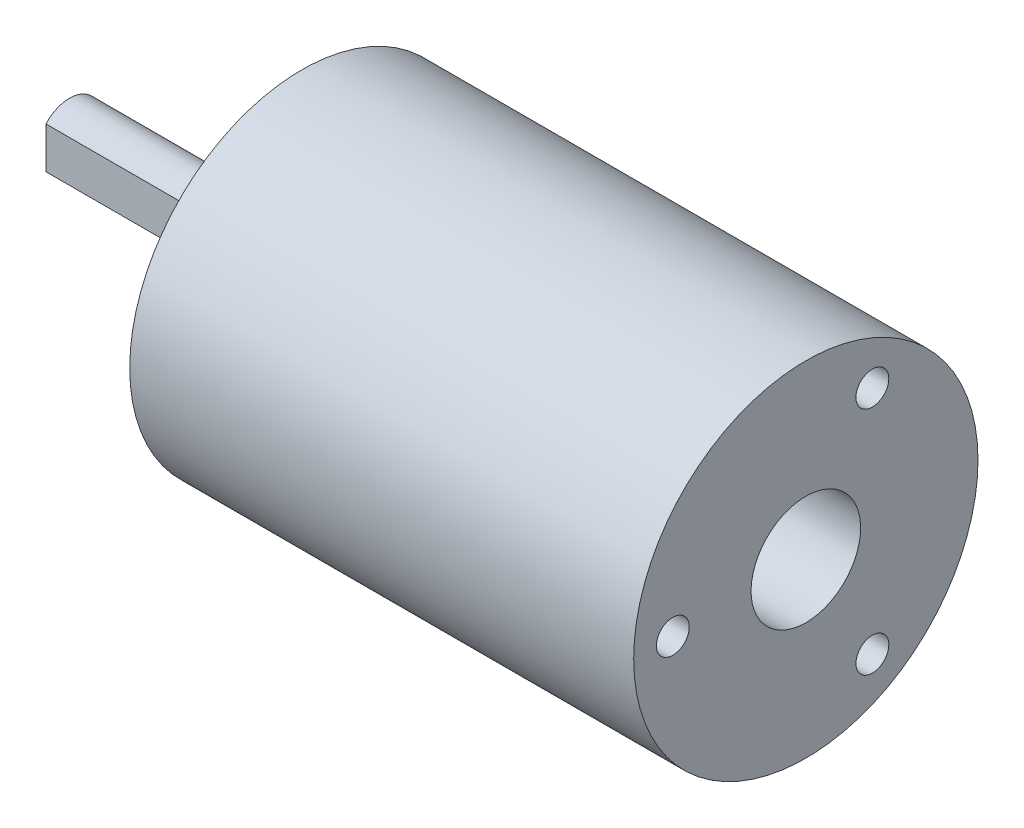
ISO-10303-21;
HEADER;
FILE_DESCRIPTION(('STEP AP214'),'2;1');
FILE_NAME('part.step','',(''),(''),'','','');
FILE_SCHEMA(('AUTOMOTIVE_DESIGN { 1 0 10303 214 1 1 1 1 }'));
ENDSEC;
DATA;
#1=APPLICATION_CONTEXT('core data for automotive mechanical design processes');
#2=APPLICATION_PROTOCOL_DEFINITION('international standard','automotive_design',2000,#1);
#3=PRODUCT_CONTEXT('',#1,'mechanical');
#4=PRODUCT('Part','Part','',(#3));
#5=PRODUCT_RELATED_PRODUCT_CATEGORY('part','',(#4));
#6=PRODUCT_DEFINITION_FORMATION('','',#4);
#7=PRODUCT_DEFINITION_CONTEXT('part definition',#1,'design');
#8=PRODUCT_DEFINITION('design','',#6,#7);
#9=PRODUCT_DEFINITION_SHAPE('','',#8);
#10=(LENGTH_UNIT() NAMED_UNIT(*) SI_UNIT(.MILLI.,.METRE.));
#11=(NAMED_UNIT(*) PLANE_ANGLE_UNIT() SI_UNIT($,.RADIAN.));
#12=(NAMED_UNIT(*) SI_UNIT($,.STERADIAN.) SOLID_ANGLE_UNIT());
#13=UNCERTAINTY_MEASURE_WITH_UNIT(LENGTH_MEASURE(1.E-05),#10,'distance_accuracy_value','');
#14=(GEOMETRIC_REPRESENTATION_CONTEXT(3) GLOBAL_UNCERTAINTY_ASSIGNED_CONTEXT((#13)) GLOBAL_UNIT_ASSIGNED_CONTEXT((#10,
#11,#12)) REPRESENTATION_CONTEXT('',''));
#15=CARTESIAN_POINT('',(0.,0.,0.));
#16=DIRECTION('',(0.,0.,1.));
#17=DIRECTION('',(1.,0.,0.));
#18=AXIS2_PLACEMENT_3D('',#15,#16,#17);
#19=CARTESIAN_POINT('',(-5.85,-1.32287565553,1.5));
#20=DIRECTION('',(-0.707106781186547,0.,0.707106781186548));
#21=DIRECTION('',(0.707106781186548,0.,0.707106781186547));
#22=AXIS2_PLACEMENT_3D('',#19,#20,#21);
#23=PLANE('',#22);
#24=CARTESIAN_POINT('',(-7.35,0.,0.));
#25=DIRECTION('',(-0.707106781186547,0.,0.707106781186548));
#26=DIRECTION('',(-0.707106781186548,0.,-0.707106781186547));
#27=AXIS2_PLACEMENT_3D('',#24,#25,#26);
#28=ELLIPSE('',#27,2.82842712474619,2.);
#29=CARTESIAN_POINT('',(-5.84999999999943,1.32287565553165,1.50000000000057));
#30=VERTEX_POINT('',#29);
#31=CARTESIAN_POINT('',(-5.84999999999943,-1.32287565553165,1.50000000000057));
#32=VERTEX_POINT('',#31);
#33=EDGE_CURVE('E18',#30,#32,#28,.F.);
#34=ORIENTED_EDGE('',*,*,#33,.F.);
#35=DIRECTION('',(0.,1.,0.));
#36=VECTOR('',#35,1.);
#37=CARTESIAN_POINT('',(-5.85,1.32287565553,1.5));
#38=LINE('',#37,#36);
#39=EDGE_CURVE('E39',#32,#30,#38,.T.);
#40=ORIENTED_EDGE('',*,*,#39,.F.);
#41=EDGE_LOOP('',(#34,#40));
#42=FACE_BOUND('',#41,.T.);
#43=ADVANCED_FACE('F15',(#42),#23,.T.);
#44=CARTESIAN_POINT('',(-14.85,1.32287565553,1.5));
#45=DIRECTION('',(0.,0.,1.));
#46=DIRECTION('',(1.,0.,0.));
#47=AXIS2_PLACEMENT_3D('',#44,#45,#46);
#48=PLANE('',#47);
#49=ORIENTED_EDGE('',*,*,#39,.T.);
#50=DIRECTION('',(-1.,0.,0.));
#51=VECTOR('',#50,1.);
#52=CARTESIAN_POINT('',(-3.14999999,1.322875655531,1.50000000000114));
#53=LINE('',#52,#51);
#54=CARTESIAN_POINT('',(-14.85,1.32287565553165,1.50000000000057));
#55=VERTEX_POINT('',#54);
#56=EDGE_CURVE('E43',#55,#30,#53,.F.);
#57=ORIENTED_EDGE('',*,*,#56,.F.);
#58=DIRECTION('',(0.,-1.,0.));
#59=VECTOR('',#58,1.);
#60=CARTESIAN_POINT('',(-14.85,1.32287565553,1.5));
#61=LINE('',#60,#59);
#62=CARTESIAN_POINT('',(-14.85,-1.32287565553165,1.50000000000057));
#63=VERTEX_POINT('',#62);
#64=EDGE_CURVE('E32',#63,#55,#61,.F.);
#65=ORIENTED_EDGE('',*,*,#64,.F.);
#66=DIRECTION('',(-1.,0.,0.));
#67=VECTOR('',#66,1.);
#68=CARTESIAN_POINT('',(-3.14999999,-1.322875655531,1.50000000000114));
#69=LINE('',#68,#67);
#70=EDGE_CURVE('E45',#32,#63,#69,.T.);
#71=ORIENTED_EDGE('',*,*,#70,.F.);
#72=EDGE_LOOP('',(#49,#57,#65,#71));
#73=FACE_BOUND('',#72,.T.);
#74=ADVANCED_FACE('F41',(#73),#48,.T.);
#75=CARTESIAN_POINT('',(-14.85,1.32287565553,1.5));
#76=DIRECTION('',(-1.,0.,0.));
#77=DIRECTION('',(0.,-1.,0.));
#78=AXIS2_PLACEMENT_3D('',#75,#76,#77);
#79=PLANE('',#78);
#80=ORIENTED_EDGE('',*,*,#64,.T.);
#81=CARTESIAN_POINT('',(-14.85,0.,0.));
#82=DIRECTION('',(-1.,0.,0.));
#83=DIRECTION('',(0.,0.,1.));
#84=AXIS2_PLACEMENT_3D('',#81,#82,#83);
#85=CIRCLE('',#84,2.);
#86=EDGE_CURVE('E52',#63,#55,#85,.F.);
#87=ORIENTED_EDGE('',*,*,#86,.F.);
#88=EDGE_LOOP('',(#80,#87));
#89=FACE_BOUND('',#88,.T.);
#90=ADVANCED_FACE('F121',(#89),#79,.T.);
#91=CARTESIAN_POINT('',(-3.14999999,0.,0.));
#92=DIRECTION('',(-1.,0.,0.));
#93=DIRECTION('',(0.,0.,1.));
#94=AXIS2_PLACEMENT_3D('',#91,#92,#93);
#95=CYLINDRICAL_SURFACE('',#94,2.);
#96=CARTESIAN_POINT('',(-3.15,0.,0.));
#97=DIRECTION('',(-1.,0.,0.));
#98=DIRECTION('',(0.,0.,1.));
#99=AXIS2_PLACEMENT_3D('',#96,#97,#98);
#100=CIRCLE('',#99,2.);
#101=CARTESIAN_POINT('',(-3.15,0.,2.));
#102=VERTEX_POINT('',#101);
#103=EDGE_CURVE('E113',#102,#102,#100,.F.);
#104=ORIENTED_EDGE('',*,*,#103,.F.);
#105=EDGE_LOOP('',(#104));
#106=FACE_BOUND('',#105,.T.);
#107=ORIENTED_EDGE('',*,*,#70,.T.);
#108=ORIENTED_EDGE('',*,*,#86,.T.);
#109=ORIENTED_EDGE('',*,*,#56,.T.);
#110=ORIENTED_EDGE('',*,*,#33,.T.);
#111=EDGE_LOOP('',(#107,#108,#109,#110));
#112=FACE_BOUND('',#111,.T.);
#113=ADVANCED_FACE('F51',(#106,#112),#95,.T.);
#114=CARTESIAN_POINT('',(-3.15,-3.5,0.));
#115=DIRECTION('',(-1.,0.,0.));
#116=DIRECTION('',(0.,-1.,0.));
#117=AXIS2_PLACEMENT_3D('',#114,#115,#116);
#118=PLANE('',#117);
#119=ORIENTED_EDGE('',*,*,#103,.T.);
#120=EDGE_LOOP('',(#119));
#121=FACE_BOUND('',#120,.T.);
#122=CARTESIAN_POINT('',(-3.15,0.,0.));
#123=DIRECTION('',(-1.,0.,0.));
#124=DIRECTION('',(0.,-1.,0.));
#125=AXIS2_PLACEMENT_3D('',#122,#123,#124);
#126=CIRCLE('',#125,3.5);
#127=CARTESIAN_POINT('',(-3.15,-3.5,0.));
#128=VERTEX_POINT('',#127);
#129=EDGE_CURVE('E110',#128,#128,#126,.F.);
#130=ORIENTED_EDGE('',*,*,#129,.F.);
#131=EDGE_LOOP('',(#130));
#132=FACE_BOUND('',#131,.T.);
#133=ADVANCED_FACE('F117',(#121,#132),#118,.T.);
#134=CARTESIAN_POINT('',(-1.34999999,0.,0.));
#135=DIRECTION('',(-1.,0.,0.));
#136=DIRECTION('',(0.,-1.,0.));
#137=AXIS2_PLACEMENT_3D('',#134,#135,#136);
#138=CYLINDRICAL_SURFACE('',#137,3.5);
#139=ORIENTED_EDGE('',*,*,#129,.T.);
#140=EDGE_LOOP('',(#139));
#141=FACE_BOUND('',#140,.T.);
#142=CARTESIAN_POINT('',(-1.35,0.,0.));
#143=DIRECTION('',(-1.,0.,0.));
#144=DIRECTION('',(0.,-1.,0.));
#145=AXIS2_PLACEMENT_3D('',#142,#143,#144);
#146=CIRCLE('',#145,3.5);
#147=CARTESIAN_POINT('',(-1.35,-3.5,0.));
#148=VERTEX_POINT('',#147);
#149=EDGE_CURVE('E107',#148,#148,#146,.F.);
#150=ORIENTED_EDGE('',*,*,#149,.F.);
#151=EDGE_LOOP('',(#150));
#152=FACE_BOUND('',#151,.T.);
#153=ADVANCED_FACE('F128',(#141,#152),#138,.T.);
#154=CARTESIAN_POINT('',(29.2,7.88621593217,-3.34067332603));
#155=DIRECTION('',(1.,0.,0.));
#156=DIRECTION('',(0.,0.,-1.));
#157=AXIS2_PLACEMENT_3D('',#154,#155,#156);
#158=PLANE('',#157);
#159=CARTESIAN_POINT('',(29.2,7.36121593217,-4.25));
#160=DIRECTION('',(-1.,0.,0.));
#161=DIRECTION('',(0.,-1.,0.));
#162=AXIS2_PLACEMENT_3D('',#159,#160,#161);
#163=CIRCLE('',#162,1.05);
#164=CARTESIAN_POINT('',(29.2,6.31121593217,-4.25));
#165=VERTEX_POINT('',#164);
#166=EDGE_CURVE('E104',#165,#165,#163,.F.);
#167=ORIENTED_EDGE('',*,*,#166,.T.);
#168=EDGE_LOOP('',(#167));
#169=FACE_BOUND('',#168,.T.);
#170=ADVANCED_FACE('F207',(#169),#158,.T.);
#171=CARTESIAN_POINT('',(29.2,-6.83621593217,-5.15932667397));
#172=DIRECTION('',(1.,0.,0.));
#173=DIRECTION('',(0.,0.,-1.));
#174=AXIS2_PLACEMENT_3D('',#171,#172,#173);
#175=PLANE('',#174);
#176=CARTESIAN_POINT('',(29.2,-7.36121593217,-4.25));
#177=DIRECTION('',(-1.,0.,0.));
#178=DIRECTION('',(0.,-1.,0.));
#179=AXIS2_PLACEMENT_3D('',#176,#177,#178);
#180=CIRCLE('',#179,1.05);
#181=CARTESIAN_POINT('',(29.2,-8.41121593217,-4.25));
#182=VERTEX_POINT('',#181);
#183=EDGE_CURVE('E101',#182,#182,#180,.F.);
#184=ORIENTED_EDGE('',*,*,#183,.T.);
#185=EDGE_LOOP('',(#184));
#186=FACE_BOUND('',#185,.T.);
#187=ADVANCED_FACE('F203',(#186),#175,.T.);
#188=CARTESIAN_POINT('',(29.2,1.05,8.5));
#189=DIRECTION('',(1.,0.,0.));
#190=DIRECTION('',(0.,0.,-1.));
#191=AXIS2_PLACEMENT_3D('',#188,#189,#190);
#192=PLANE('',#191);
#193=CARTESIAN_POINT('',(29.2,0.,8.5));
#194=DIRECTION('',(-1.,0.,0.));
#195=DIRECTION('',(0.,-1.,0.));
#196=AXIS2_PLACEMENT_3D('',#193,#194,#195);
#197=CIRCLE('',#196,1.05);
#198=CARTESIAN_POINT('',(29.2,-1.05,8.5));
#199=VERTEX_POINT('',#198);
#200=EDGE_CURVE('E98',#199,#199,#197,.F.);
#201=ORIENTED_EDGE('',*,*,#200,.T.);
#202=EDGE_LOOP('',(#201));
#203=FACE_BOUND('',#202,.T.);
#204=ADVANCED_FACE('F199',(#203),#192,.T.);
#205=CARTESIAN_POINT('',(25.8,3.5,0.));
#206=DIRECTION('',(1.,0.,0.));
#207=DIRECTION('',(0.,0.,-1.));
#208=AXIS2_PLACEMENT_3D('',#205,#206,#207);
#209=PLANE('',#208);
#210=CARTESIAN_POINT('',(25.8,0.,0.));
#211=DIRECTION('',(-1.,0.,0.));
#212=DIRECTION('',(0.,-1.,0.));
#213=AXIS2_PLACEMENT_3D('',#210,#211,#212);
#214=CIRCLE('',#213,3.5);
#215=CARTESIAN_POINT('',(25.8,-3.5,0.));
#216=VERTEX_POINT('',#215);
#217=EDGE_CURVE('E95',#216,#216,#214,.F.);
#218=ORIENTED_EDGE('',*,*,#217,.T.);
#219=EDGE_LOOP('',(#218));
#220=FACE_BOUND('',#219,.T.);
#221=ADVANCED_FACE('F195',(#220),#209,.T.);
#222=CARTESIAN_POINT('',(6.5,6.54967782649,-2.65562523131));
#223=DIRECTION('',(-1.,0.,0.));
#224=DIRECTION('',(0.,-1.,0.));
#225=AXIS2_PLACEMENT_3D('',#222,#223,#224);
#226=PLANE('',#225);
#227=CARTESIAN_POINT('',(6.5,6.06217782649,-3.5));
#228=DIRECTION('',(1.,0.,0.));
#229=DIRECTION('',(0.,0.,-1.));
#230=AXIS2_PLACEMENT_3D('',#227,#228,#229);
#231=CIRCLE('',#230,0.975);
#232=CARTESIAN_POINT('',(6.5,6.06217782649,-4.475));
#233=VERTEX_POINT('',#232);
#234=EDGE_CURVE('E92',#233,#233,#231,.F.);
#235=ORIENTED_EDGE('',*,*,#234,.T.);
#236=EDGE_LOOP('',(#235));
#237=FACE_BOUND('',#236,.T.);
#238=ADVANCED_FACE('F191',(#237),#226,.T.);
#239=CARTESIAN_POINT('',(6.5,-5.57467782649,-4.34437476869));
#240=DIRECTION('',(-1.,0.,0.));
#241=DIRECTION('',(0.,-1.,0.));
#242=AXIS2_PLACEMENT_3D('',#239,#240,#241);
#243=PLANE('',#242);
#244=CARTESIAN_POINT('',(6.5,-6.06217782649,-3.5));
#245=DIRECTION('',(1.,0.,0.));
#246=DIRECTION('',(0.,0.,-1.));
#247=AXIS2_PLACEMENT_3D('',#244,#245,#246);
#248=CIRCLE('',#247,0.975);
#249=CARTESIAN_POINT('',(6.5,-6.06217782649,-4.475));
#250=VERTEX_POINT('',#249);
#251=EDGE_CURVE('E89',#250,#250,#248,.F.);
#252=ORIENTED_EDGE('',*,*,#251,.T.);
#253=EDGE_LOOP('',(#252));
#254=FACE_BOUND('',#253,.T.);
#255=ADVANCED_FACE('F187',(#254),#243,.T.);
#256=CARTESIAN_POINT('',(6.5,0.975,7.));
#257=DIRECTION('',(-1.,0.,0.));
#258=DIRECTION('',(0.,-1.,0.));
#259=AXIS2_PLACEMENT_3D('',#256,#257,#258);
#260=PLANE('',#259);
#261=CARTESIAN_POINT('',(6.5,0.,7.));
#262=DIRECTION('',(1.,0.,0.));
#263=DIRECTION('',(0.,0.,-1.));
#264=AXIS2_PLACEMENT_3D('',#261,#262,#263);
#265=CIRCLE('',#264,0.975);
#266=CARTESIAN_POINT('',(6.5,0.,6.025));
#267=VERTEX_POINT('',#266);
#268=EDGE_CURVE('E86',#267,#267,#265,.F.);
#269=ORIENTED_EDGE('',*,*,#268,.T.);
#270=EDGE_LOOP('',(#269));
#271=FACE_BOUND('',#270,.T.);
#272=ADVANCED_FACE('F183',(#271),#260,.T.);
#273=CARTESIAN_POINT('',(-1.35,5.,0.));
#274=DIRECTION('',(-1.,0.,0.));
#275=DIRECTION('',(0.,-1.,0.));
#276=AXIS2_PLACEMENT_3D('',#273,#274,#275);
#277=PLANE('',#276);
#278=ORIENTED_EDGE('',*,*,#149,.T.);
#279=EDGE_LOOP('',(#278));
#280=FACE_BOUND('',#279,.T.);
#281=CARTESIAN_POINT('',(-1.35,0.,0.));
#282=DIRECTION('',(1.,0.,0.));
#283=DIRECTION('',(0.,0.,-1.));
#284=AXIS2_PLACEMENT_3D('',#281,#282,#283);
#285=CIRCLE('',#284,5.);
#286=CARTESIAN_POINT('',(-1.35,0.,-5.));
#287=VERTEX_POINT('',#286);
#288=EDGE_CURVE('E83',#287,#287,#285,.T.);
#289=ORIENTED_EDGE('',*,*,#288,.F.);
#290=EDGE_LOOP('',(#289));
#291=FACE_BOUND('',#290,.T.);
#292=ADVANCED_FACE('F179',(#280,#291),#277,.T.);
#293=CARTESIAN_POINT('',(32.20000001,7.36121593217,-4.25));
#294=DIRECTION('',(-1.,0.,0.));
#295=DIRECTION('',(0.,-1.,0.));
#296=AXIS2_PLACEMENT_3D('',#293,#294,#295);
#297=CYLINDRICAL_SURFACE('',#296,1.05);
#298=ORIENTED_EDGE('',*,*,#166,.F.);
#299=EDGE_LOOP('',(#298));
#300=FACE_BOUND('',#299,.T.);
#301=CARTESIAN_POINT('',(32.2,7.36121593217,-4.25));
#302=DIRECTION('',(-1.,0.,0.));
#303=DIRECTION('',(0.,-1.,0.));
#304=AXIS2_PLACEMENT_3D('',#301,#302,#303);
#305=CIRCLE('',#304,1.05);
#306=CARTESIAN_POINT('',(32.2,6.31121593217,-4.25));
#307=VERTEX_POINT('',#306);
#308=EDGE_CURVE('E80',#307,#307,#305,.T.);
#309=ORIENTED_EDGE('',*,*,#308,.F.);
#310=EDGE_LOOP('',(#309));
#311=FACE_BOUND('',#310,.T.);
#312=ADVANCED_FACE('F175',(#300,#311),#297,.F.);
#313=CARTESIAN_POINT('',(32.20000001,-7.36121593217,-4.25));
#314=DIRECTION('',(-1.,0.,0.));
#315=DIRECTION('',(0.,-1.,0.));
#316=AXIS2_PLACEMENT_3D('',#313,#314,#315);
#317=CYLINDRICAL_SURFACE('',#316,1.05);
#318=ORIENTED_EDGE('',*,*,#183,.F.);
#319=EDGE_LOOP('',(#318));
#320=FACE_BOUND('',#319,.T.);
#321=CARTESIAN_POINT('',(32.2,-7.36121593217,-4.25));
#322=DIRECTION('',(-1.,0.,0.));
#323=DIRECTION('',(0.,-1.,0.));
#324=AXIS2_PLACEMENT_3D('',#321,#322,#323);
#325=CIRCLE('',#324,1.05);
#326=CARTESIAN_POINT('',(32.2,-8.41121593217,-4.25));
#327=VERTEX_POINT('',#326);
#328=EDGE_CURVE('E77',#327,#327,#325,.T.);
#329=ORIENTED_EDGE('',*,*,#328,.F.);
#330=EDGE_LOOP('',(#329));
#331=FACE_BOUND('',#330,.T.);
#332=ADVANCED_FACE('F171',(#320,#331),#317,.F.);
#333=CARTESIAN_POINT('',(32.20000001,0.,8.5));
#334=DIRECTION('',(-1.,0.,0.));
#335=DIRECTION('',(0.,-1.,0.));
#336=AXIS2_PLACEMENT_3D('',#333,#334,#335);
#337=CYLINDRICAL_SURFACE('',#336,1.05);
#338=ORIENTED_EDGE('',*,*,#200,.F.);
#339=EDGE_LOOP('',(#338));
#340=FACE_BOUND('',#339,.T.);
#341=CARTESIAN_POINT('',(32.2,0.,8.5));
#342=DIRECTION('',(-1.,0.,0.));
#343=DIRECTION('',(0.,-1.,0.));
#344=AXIS2_PLACEMENT_3D('',#341,#342,#343);
#345=CIRCLE('',#344,1.05);
#346=CARTESIAN_POINT('',(32.2,-1.05,8.5));
#347=VERTEX_POINT('',#346);
#348=EDGE_CURVE('E74',#347,#347,#345,.T.);
#349=ORIENTED_EDGE('',*,*,#348,.F.);
#350=EDGE_LOOP('',(#349));
#351=FACE_BOUND('',#350,.T.);
#352=ADVANCED_FACE('F167',(#340,#351),#337,.F.);
#353=CARTESIAN_POINT('',(32.20000001,0.,0.));
#354=DIRECTION('',(-1.,0.,0.));
#355=DIRECTION('',(0.,-1.,0.));
#356=AXIS2_PLACEMENT_3D('',#353,#354,#355);
#357=CYLINDRICAL_SURFACE('',#356,3.5);
#358=ORIENTED_EDGE('',*,*,#217,.F.);
#359=EDGE_LOOP('',(#358));
#360=FACE_BOUND('',#359,.T.);
#361=CARTESIAN_POINT('',(32.2,0.,0.));
#362=DIRECTION('',(-1.,0.,0.));
#363=DIRECTION('',(0.,-1.,0.));
#364=AXIS2_PLACEMENT_3D('',#361,#362,#363);
#365=CIRCLE('',#364,3.5);
#366=CARTESIAN_POINT('',(32.2,-3.5,0.));
#367=VERTEX_POINT('',#366);
#368=EDGE_CURVE('E71',#367,#367,#365,.T.);
#369=ORIENTED_EDGE('',*,*,#368,.F.);
#370=EDGE_LOOP('',(#369));
#371=FACE_BOUND('',#370,.T.);
#372=ADVANCED_FACE('F163',(#360,#371),#357,.F.);
#373=CARTESIAN_POINT('',(-9.99999993922529E-09,6.06217782649,-3.5));
#374=DIRECTION('',(1.,0.,0.));
#375=DIRECTION('',(0.,0.,-1.));
#376=AXIS2_PLACEMENT_3D('',#373,#374,#375);
#377=CYLINDRICAL_SURFACE('',#376,0.975);
#378=ORIENTED_EDGE('',*,*,#234,.F.);
#379=EDGE_LOOP('',(#378));
#380=FACE_BOUND('',#379,.T.);
#381=CARTESIAN_POINT('',(0.,6.06217782649,-3.5));
#382=DIRECTION('',(1.,0.,0.));
#383=DIRECTION('',(0.,0.,-1.));
#384=AXIS2_PLACEMENT_3D('',#381,#382,#383);
#385=CIRCLE('',#384,0.975);
#386=CARTESIAN_POINT('',(0.,6.06217782649,-4.475));
#387=VERTEX_POINT('',#386);
#388=EDGE_CURVE('E68',#387,#387,#385,.T.);
#389=ORIENTED_EDGE('',*,*,#388,.F.);
#390=EDGE_LOOP('',(#389));
#391=FACE_BOUND('',#390,.T.);
#392=ADVANCED_FACE('F159',(#380,#391),#377,.F.);
#393=CARTESIAN_POINT('',(-9.99999993922529E-09,-6.06217782649,-3.5));
#394=DIRECTION('',(1.,0.,0.));
#395=DIRECTION('',(0.,0.,-1.));
#396=AXIS2_PLACEMENT_3D('',#393,#394,#395);
#397=CYLINDRICAL_SURFACE('',#396,0.975);
#398=ORIENTED_EDGE('',*,*,#251,.F.);
#399=EDGE_LOOP('',(#398));
#400=FACE_BOUND('',#399,.T.);
#401=CARTESIAN_POINT('',(0.,-6.06217782649,-3.5));
#402=DIRECTION('',(1.,0.,0.));
#403=DIRECTION('',(0.,0.,-1.));
#404=AXIS2_PLACEMENT_3D('',#401,#402,#403);
#405=CIRCLE('',#404,0.975);
#406=CARTESIAN_POINT('',(0.,-6.06217782649,-4.475));
#407=VERTEX_POINT('',#406);
#408=EDGE_CURVE('E65',#407,#407,#405,.T.);
#409=ORIENTED_EDGE('',*,*,#408,.F.);
#410=EDGE_LOOP('',(#409));
#411=FACE_BOUND('',#410,.T.);
#412=ADVANCED_FACE('F155',(#400,#411),#397,.F.);
#413=CARTESIAN_POINT('',(-9.99999993922529E-09,0.,7.));
#414=DIRECTION('',(1.,0.,0.));
#415=DIRECTION('',(0.,0.,-1.));
#416=AXIS2_PLACEMENT_3D('',#413,#414,#415);
#417=CYLINDRICAL_SURFACE('',#416,0.975);
#418=ORIENTED_EDGE('',*,*,#268,.F.);
#419=EDGE_LOOP('',(#418));
#420=FACE_BOUND('',#419,.T.);
#421=CARTESIAN_POINT('',(0.,0.,7.));
#422=DIRECTION('',(1.,0.,0.));
#423=DIRECTION('',(0.,0.,-1.));
#424=AXIS2_PLACEMENT_3D('',#421,#422,#423);
#425=CIRCLE('',#424,0.975);
#426=CARTESIAN_POINT('',(0.,0.,6.025));
#427=VERTEX_POINT('',#426);
#428=EDGE_CURVE('E62',#427,#427,#425,.T.);
#429=ORIENTED_EDGE('',*,*,#428,.F.);
#430=EDGE_LOOP('',(#429));
#431=FACE_BOUND('',#430,.T.);
#432=ADVANCED_FACE('F151',(#420,#431),#417,.F.);
#433=CARTESIAN_POINT('',(-1.35000001,0.,0.));
#434=DIRECTION('',(1.,0.,0.));
#435=DIRECTION('',(0.,0.,-1.));
#436=AXIS2_PLACEMENT_3D('',#433,#434,#435);
#437=CYLINDRICAL_SURFACE('',#436,5.);
#438=ORIENTED_EDGE('',*,*,#288,.T.);
#439=EDGE_LOOP('',(#438));
#440=FACE_BOUND('',#439,.T.);
#441=CARTESIAN_POINT('',(0.,0.,0.));
#442=DIRECTION('',(1.,0.,0.));
#443=DIRECTION('',(0.,0.,-1.));
#444=AXIS2_PLACEMENT_3D('',#441,#442,#443);
#445=CIRCLE('',#444,5.);
#446=CARTESIAN_POINT('',(0.,0.,-5.));
#447=VERTEX_POINT('',#446);
#448=EDGE_CURVE('E59',#447,#447,#445,.T.);
#449=ORIENTED_EDGE('',*,*,#448,.F.);
#450=EDGE_LOOP('',(#449));
#451=FACE_BOUND('',#450,.T.);
#452=ADVANCED_FACE('F147',(#440,#451),#437,.T.);
#453=CARTESIAN_POINT('',(32.2,0.,11.));
#454=DIRECTION('',(1.,0.,0.));
#455=DIRECTION('',(0.,0.,-1.));
#456=AXIS2_PLACEMENT_3D('',#453,#454,#455);
#457=PLANE('',#456);
#458=ORIENTED_EDGE('',*,*,#368,.T.);
#459=EDGE_LOOP('',(#458));
#460=FACE_BOUND('',#459,.T.);
#461=ORIENTED_EDGE('',*,*,#348,.T.);
#462=EDGE_LOOP('',(#461));
#463=FACE_BOUND('',#462,.T.);
#464=ORIENTED_EDGE('',*,*,#328,.T.);
#465=EDGE_LOOP('',(#464));
#466=FACE_BOUND('',#465,.T.);
#467=ORIENTED_EDGE('',*,*,#308,.T.);
#468=EDGE_LOOP('',(#467));
#469=FACE_BOUND('',#468,.T.);
#470=CARTESIAN_POINT('',(32.2,0.,0.));
#471=DIRECTION('',(1.,0.,0.));
#472=DIRECTION('',(0.,0.,-1.));
#473=AXIS2_PLACEMENT_3D('',#470,#471,#472);
#474=CIRCLE('',#473,11.);
#475=CARTESIAN_POINT('',(32.2,0.,-11.));
#476=VERTEX_POINT('',#475);
#477=EDGE_CURVE('E24',#476,#476,#474,.F.);
#478=ORIENTED_EDGE('',*,*,#477,.F.);
#479=EDGE_LOOP('',(#478));
#480=FACE_BOUND('',#479,.T.);
#481=ADVANCED_FACE('F140',(#460,#463,#466,#469,#480),#457,.T.);
#482=CARTESIAN_POINT('',(0.,0.,11.));
#483=DIRECTION('',(-1.,0.,0.));
#484=DIRECTION('',(0.,-1.,0.));
#485=AXIS2_PLACEMENT_3D('',#482,#483,#484);
#486=PLANE('',#485);
#487=ORIENTED_EDGE('',*,*,#448,.T.);
#488=EDGE_LOOP('',(#487));
#489=FACE_BOUND('',#488,.T.);
#490=ORIENTED_EDGE('',*,*,#428,.T.);
#491=EDGE_LOOP('',(#490));
#492=FACE_BOUND('',#491,.T.);
#493=ORIENTED_EDGE('',*,*,#408,.T.);
#494=EDGE_LOOP('',(#493));
#495=FACE_BOUND('',#494,.T.);
#496=ORIENTED_EDGE('',*,*,#388,.T.);
#497=EDGE_LOOP('',(#496));
#498=FACE_BOUND('',#497,.T.);
#499=CARTESIAN_POINT('',(0.,0.,0.));
#500=DIRECTION('',(1.,0.,0.));
#501=DIRECTION('',(0.,0.,-1.));
#502=AXIS2_PLACEMENT_3D('',#499,#500,#501);
#503=CIRCLE('',#502,11.);
#504=CARTESIAN_POINT('',(0.,0.,-11.));
#505=VERTEX_POINT('',#504);
#506=EDGE_CURVE('E10',#505,#505,#503,.T.);
#507=ORIENTED_EDGE('',*,*,#506,.F.);
#508=EDGE_LOOP('',(#507));
#509=FACE_BOUND('',#508,.T.);
#510=ADVANCED_FACE('F134',(#489,#492,#495,#498,#509),#486,.T.);
#511=CARTESIAN_POINT('',(1.59999999,0.,0.));
#512=DIRECTION('',(1.,0.,0.));
#513=DIRECTION('',(0.,0.,-1.));
#514=AXIS2_PLACEMENT_3D('',#511,#512,#513);
#515=CYLINDRICAL_SURFACE('',#514,11.);
#516=ORIENTED_EDGE('',*,*,#506,.T.);
#517=EDGE_LOOP('',(#516));
#518=FACE_BOUND('',#517,.T.);
#519=ORIENTED_EDGE('',*,*,#477,.T.);
#520=EDGE_LOOP('',(#519));
#521=FACE_BOUND('',#520,.T.);
#522=ADVANCED_FACE('F132',(#518,#521),#515,.T.);
#523=CLOSED_SHELL('',(#43,#74,#90,#113,#133,#153,#170,#187,#204,#221,#238,#255,#272,#292,#312,
#332,#352,#372,#392,#412,#432,#452,#481,#510,#522));
#524=MANIFOLD_SOLID_BREP('B1',#523);
#525=ADVANCED_BREP_SHAPE_REPRESENTATION('',(#18,#524),#14);
#526=SHAPE_DEFINITION_REPRESENTATION(#9,#525);
ENDSEC;
END-ISO-10303-21;
